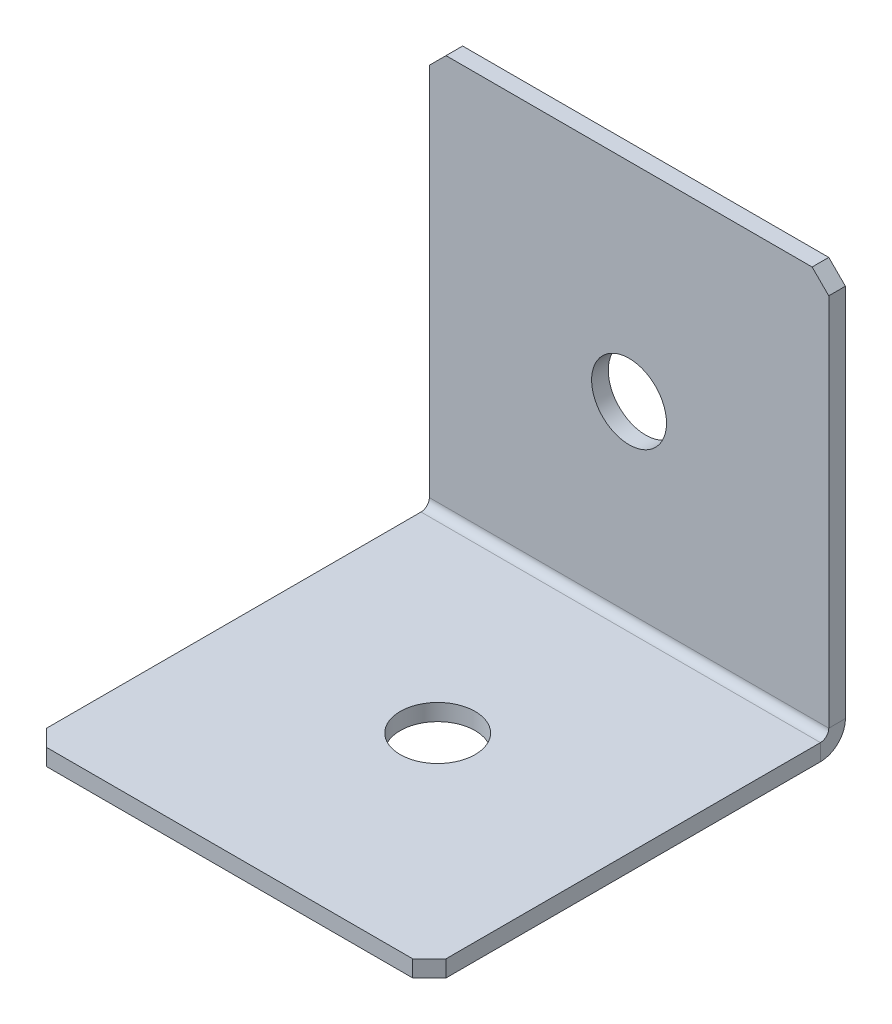
ISO-10303-21;
HEADER;
FILE_DESCRIPTION(('STEP AP214'),'2;1');
FILE_NAME('part.step','',(''),(''),'','','');
FILE_SCHEMA(('AUTOMOTIVE_DESIGN { 1 0 10303 214 1 1 1 1 }'));
ENDSEC;
DATA;
#1=APPLICATION_CONTEXT('core data for automotive mechanical design processes');
#2=APPLICATION_PROTOCOL_DEFINITION('international standard','automotive_design',2000,#1);
#3=PRODUCT_CONTEXT('',#1,'mechanical');
#4=PRODUCT('Part','Part','',(#3));
#5=PRODUCT_RELATED_PRODUCT_CATEGORY('part','',(#4));
#6=PRODUCT_DEFINITION_FORMATION('','',#4);
#7=PRODUCT_DEFINITION_CONTEXT('part definition',#1,'design');
#8=PRODUCT_DEFINITION('design','',#6,#7);
#9=PRODUCT_DEFINITION_SHAPE('','',#8);
#10=(LENGTH_UNIT() NAMED_UNIT(*) SI_UNIT(.MILLI.,.METRE.));
#11=(NAMED_UNIT(*) PLANE_ANGLE_UNIT() SI_UNIT($,.RADIAN.));
#12=(NAMED_UNIT(*) SI_UNIT($,.STERADIAN.) SOLID_ANGLE_UNIT());
#13=UNCERTAINTY_MEASURE_WITH_UNIT(LENGTH_MEASURE(1.E-05),#10,'distance_accuracy_value','');
#14=(GEOMETRIC_REPRESENTATION_CONTEXT(3) GLOBAL_UNCERTAINTY_ASSIGNED_CONTEXT((#13)) GLOBAL_UNIT_ASSIGNED_CONTEXT((#10,
#11,#12)) REPRESENTATION_CONTEXT('',''));
#15=CARTESIAN_POINT('',(0.,0.,0.));
#16=DIRECTION('',(0.,0.,1.));
#17=DIRECTION('',(1.,0.,0.));
#18=AXIS2_PLACEMENT_3D('',#15,#16,#17);
#19=CARTESIAN_POINT('',(24.,0.,2.));
#20=DIRECTION('',(-1.,0.,0.));
#21=DIRECTION('',(0.,1.,0.));
#22=AXIS2_PLACEMENT_3D('',#19,#20,#21);
#23=PLANE('',#22);
#24=DIRECTION('',(0.,1.,0.));
#25=VECTOR('',#24,1.);
#26=CARTESIAN_POINT('',(24.,0.,0.));
#27=LINE('',#26,#25);
#28=CARTESIAN_POINT('',(24.,3.,0.));
#29=VERTEX_POINT('',#28);
#30=CARTESIAN_POINT('',(24.,48.,0.));
#31=VERTEX_POINT('',#30);
#32=EDGE_CURVE('E259',#29,#31,#27,.T.);
#33=ORIENTED_EDGE('',*,*,#32,.T.);
#34=DIRECTION('',(0.,0.,-1.));
#35=VECTOR('',#34,1.);
#36=CARTESIAN_POINT('',(24.,48.,2.));
#37=LINE('',#36,#35);
#38=CARTESIAN_POINT('',(24.,48.,2.));
#39=VERTEX_POINT('',#38);
#40=EDGE_CURVE('E289',#31,#39,#37,.F.);
#41=ORIENTED_EDGE('',*,*,#40,.T.);
#42=DIRECTION('',(0.,1.,0.));
#43=VECTOR('',#42,1.);
#44=CARTESIAN_POINT('',(24.,0.,2.));
#45=LINE('',#44,#43);
#46=CARTESIAN_POINT('',(24.,3.,2.));
#47=VERTEX_POINT('',#46);
#48=EDGE_CURVE('E247',#47,#39,#45,.T.);
#49=ORIENTED_EDGE('',*,*,#48,.F.);
#50=DIRECTION('',(0.,0.,-1.));
#51=VECTOR('',#50,1.);
#52=CARTESIAN_POINT('',(24.,3.,2.));
#53=LINE('',#52,#51);
#54=EDGE_CURVE('E226',#47,#29,#53,.T.);
#55=ORIENTED_EDGE('',*,*,#54,.T.);
#56=EDGE_LOOP('',(#33,#41,#49,#55));
#57=FACE_BOUND('',#56,.T.);
#58=ADVANCED_FACE('F65',(#57),#23,.F.);
#59=CARTESIAN_POINT('',(0.,0.,2.));
#60=DIRECTION('',(0.,0.,-1.));
#61=DIRECTION('',(-1.,0.,0.));
#62=AXIS2_PLACEMENT_3D('',#59,#60,#61);
#63=PLANE('',#62);
#64=CARTESIAN_POINT('',(0.,25.,2.));
#65=DIRECTION('',(0.,0.,1.));
#66=DIRECTION('',(1.,0.,0.));
#67=AXIS2_PLACEMENT_3D('',#64,#65,#66);
#68=CIRCLE('',#67,4.5);
#69=CARTESIAN_POINT('',(4.5,25.,2.));
#70=VERTEX_POINT('',#69);
#71=EDGE_CURVE('E559',#70,#70,#68,.T.);
#72=ORIENTED_EDGE('',*,*,#71,.F.);
#73=EDGE_LOOP('',(#72));
#74=FACE_BOUND('',#73,.T.);
#75=ORIENTED_EDGE('',*,*,#48,.T.);
#76=DIRECTION('',(0.707106781186549,-0.707106781186546,0.));
#77=VECTOR('',#76,1.);
#78=CARTESIAN_POINT('',(24.,48.,2.));
#79=LINE('',#78,#77);
#80=CARTESIAN_POINT('',(22.,50.,2.));
#81=VERTEX_POINT('',#80);
#82=EDGE_CURVE('E296',#39,#81,#79,.F.);
#83=ORIENTED_EDGE('',*,*,#82,.T.);
#84=DIRECTION('',(-1.,0.,0.));
#85=VECTOR('',#84,1.);
#86=CARTESIAN_POINT('',(-24.,50.,2.));
#87=LINE('',#86,#85);
#88=CARTESIAN_POINT('',(-22.,50.,2.));
#89=VERTEX_POINT('',#88);
#90=EDGE_CURVE('E252',#81,#89,#87,.T.);
#91=ORIENTED_EDGE('',*,*,#90,.T.);
#92=DIRECTION('',(0.707106781186548,0.707106781186548,0.));
#93=VECTOR('',#92,1.);
#94=CARTESIAN_POINT('',(-22.,50.,2.));
#95=LINE('',#94,#93);
#96=CARTESIAN_POINT('',(-24.,48.,2.));
#97=VERTEX_POINT('',#96);
#98=EDGE_CURVE('E293',#89,#97,#95,.F.);
#99=ORIENTED_EDGE('',*,*,#98,.T.);
#100=DIRECTION('',(0.,-1.,0.));
#101=VECTOR('',#100,1.);
#102=CARTESIAN_POINT('',(-24.,0.,2.));
#103=LINE('',#102,#101);
#104=CARTESIAN_POINT('',(-24.,3.,2.));
#105=VERTEX_POINT('',#104);
#106=EDGE_CURVE('E244',#97,#105,#103,.T.);
#107=ORIENTED_EDGE('',*,*,#106,.T.);
#108=DIRECTION('',(1.,0.,0.));
#109=VECTOR('',#108,1.);
#110=CARTESIAN_POINT('',(24.,3.,2.));
#111=LINE('',#110,#109);
#112=EDGE_CURVE('E231',#47,#105,#111,.F.);
#113=ORIENTED_EDGE('',*,*,#112,.F.);
#114=EDGE_LOOP('',(#75,#83,#91,#99,#107,#113));
#115=FACE_BOUND('',#114,.T.);
#116=ADVANCED_FACE('F319',(#74,#115),#63,.F.);
#117=CARTESIAN_POINT('',(0.,0.,0.));
#118=DIRECTION('',(0.,0.,-1.));
#119=DIRECTION('',(-1.,0.,0.));
#120=AXIS2_PLACEMENT_3D('',#117,#118,#119);
#121=PLANE('',#120);
#122=CARTESIAN_POINT('',(0.,25.,0.));
#123=DIRECTION('',(0.,0.,-1.));
#124=DIRECTION('',(-1.,0.,0.));
#125=AXIS2_PLACEMENT_3D('',#122,#123,#124);
#126=CIRCLE('',#125,4.5);
#127=CARTESIAN_POINT('',(-4.5,25.,0.));
#128=VERTEX_POINT('',#127);
#129=EDGE_CURVE('E221',#128,#128,#126,.T.);
#130=ORIENTED_EDGE('',*,*,#129,.F.);
#131=EDGE_LOOP('',(#130));
#132=FACE_BOUND('',#131,.T.);
#133=DIRECTION('',(-1.,0.,0.));
#134=VECTOR('',#133,1.);
#135=CARTESIAN_POINT('',(0.,50.,0.));
#136=LINE('',#135,#134);
#137=CARTESIAN_POINT('',(22.,50.,0.));
#138=VERTEX_POINT('',#137);
#139=CARTESIAN_POINT('',(-22.,50.,0.));
#140=VERTEX_POINT('',#139);
#141=EDGE_CURVE('E248',#138,#140,#136,.T.);
#142=ORIENTED_EDGE('',*,*,#141,.F.);
#143=DIRECTION('',(-0.707106781186549,0.707106781186546,0.));
#144=VECTOR('',#143,1.);
#145=CARTESIAN_POINT('',(36.,36.0000000000001,0.));
#146=LINE('',#145,#144);
#147=EDGE_CURVE('E75',#138,#31,#146,.F.);
#148=ORIENTED_EDGE('',*,*,#147,.T.);
#149=ORIENTED_EDGE('',*,*,#32,.F.);
#150=DIRECTION('',(1.,0.,0.));
#151=VECTOR('',#150,1.);
#152=CARTESIAN_POINT('',(24.,3.,0.));
#153=LINE('',#152,#151);
#154=CARTESIAN_POINT('',(-24.,3.00000000000001,0.));
#155=VERTEX_POINT('',#154);
#156=EDGE_CURVE('E164',#29,#155,#153,.F.);
#157=ORIENTED_EDGE('',*,*,#156,.T.);
#158=DIRECTION('',(0.,1.,0.));
#159=VECTOR('',#158,1.);
#160=CARTESIAN_POINT('',(-24.,0.,0.));
#161=LINE('',#160,#159);
#162=CARTESIAN_POINT('',(-24.,48.,0.));
#163=VERTEX_POINT('',#162);
#164=EDGE_CURVE('E241',#163,#155,#161,.F.);
#165=ORIENTED_EDGE('',*,*,#164,.F.);
#166=DIRECTION('',(-0.707106781186548,-0.707106781186548,0.));
#167=VECTOR('',#166,1.);
#168=CARTESIAN_POINT('',(-36.,36.,0.));
#169=LINE('',#168,#167);
#170=EDGE_CURVE('E87',#163,#140,#169,.F.);
#171=ORIENTED_EDGE('',*,*,#170,.T.);
#172=EDGE_LOOP('',(#142,#148,#149,#157,#165,#171));
#173=FACE_BOUND('',#172,.T.);
#174=ADVANCED_FACE('F310',(#132,#173),#121,.T.);
#175=CARTESIAN_POINT('',(-24.,50.,2.));
#176=DIRECTION('',(0.,-1.,0.));
#177=DIRECTION('',(-1.,0.,0.));
#178=AXIS2_PLACEMENT_3D('',#175,#176,#177);
#179=PLANE('',#178);
#180=ORIENTED_EDGE('',*,*,#90,.F.);
#181=DIRECTION('',(0.,0.,1.));
#182=VECTOR('',#181,1.);
#183=CARTESIAN_POINT('',(22.,50.,2.));
#184=LINE('',#183,#182);
#185=EDGE_CURVE('E303',#81,#138,#184,.F.);
#186=ORIENTED_EDGE('',*,*,#185,.T.);
#187=ORIENTED_EDGE('',*,*,#141,.T.);
#188=DIRECTION('',(0.,0.,-1.));
#189=VECTOR('',#188,1.);
#190=CARTESIAN_POINT('',(-22.,50.,2.));
#191=LINE('',#190,#189);
#192=EDGE_CURVE('E299',#140,#89,#191,.F.);
#193=ORIENTED_EDGE('',*,*,#192,.T.);
#194=EDGE_LOOP('',(#180,#186,#187,#193));
#195=FACE_BOUND('',#194,.T.);
#196=ADVANCED_FACE('F322',(#195),#179,.F.);
#197=CARTESIAN_POINT('',(-24.,0.,2.));
#198=DIRECTION('',(1.,0.,0.));
#199=DIRECTION('',(0.,-1.,0.));
#200=AXIS2_PLACEMENT_3D('',#197,#198,#199);
#201=PLANE('',#200);
#202=ORIENTED_EDGE('',*,*,#106,.F.);
#203=DIRECTION('',(0.,0.,1.));
#204=VECTOR('',#203,1.);
#205=CARTESIAN_POINT('',(-24.,48.,2.));
#206=LINE('',#205,#204);
#207=EDGE_CURVE('E13',#97,#163,#206,.F.);
#208=ORIENTED_EDGE('',*,*,#207,.T.);
#209=ORIENTED_EDGE('',*,*,#164,.T.);
#210=DIRECTION('',(0.,0.,-1.));
#211=VECTOR('',#210,1.);
#212=CARTESIAN_POINT('',(-24.,3.,2.));
#213=LINE('',#212,#211);
#214=EDGE_CURVE('E237',#105,#155,#213,.T.);
#215=ORIENTED_EDGE('',*,*,#214,.F.);
#216=EDGE_LOOP('',(#202,#208,#209,#215));
#217=FACE_BOUND('',#216,.T.);
#218=ADVANCED_FACE('F326',(#217),#201,.F.);
#219=CARTESIAN_POINT('',(-24.,3.,3.));
#220=DIRECTION('',(-1.,0.,0.));
#221=DIRECTION('',(0.,0.,1.));
#222=AXIS2_PLACEMENT_3D('',#219,#220,#221);
#223=PLANE('',#222);
#224=DIRECTION('',(0.,1.,0.));
#225=VECTOR('',#224,1.);
#226=CARTESIAN_POINT('',(-24.,0.,2.99999999999999));
#227=LINE('',#226,#225);
#228=CARTESIAN_POINT('',(-24.,2.,3.));
#229=VERTEX_POINT('',#228);
#230=CARTESIAN_POINT('',(-24.,0.,2.99999999999999));
#231=VERTEX_POINT('',#230);
#232=EDGE_CURVE('E217',#229,#231,#227,.F.);
#233=ORIENTED_EDGE('',*,*,#232,.F.);
#234=CARTESIAN_POINT('',(-24.,3.,3.));
#235=DIRECTION('',(1.,0.,0.));
#236=DIRECTION('',(0.,0.,-1.));
#237=AXIS2_PLACEMENT_3D('',#234,#235,#236);
#238=CIRCLE('',#237,1.);
#239=EDGE_CURVE('E168',#105,#229,#238,.F.);
#240=ORIENTED_EDGE('',*,*,#239,.F.);
#241=ORIENTED_EDGE('',*,*,#214,.T.);
#242=CARTESIAN_POINT('',(-24.,3.,3.));
#243=DIRECTION('',(1.,0.,0.));
#244=DIRECTION('',(0.,0.,-1.));
#245=AXIS2_PLACEMENT_3D('',#242,#243,#244);
#246=CIRCLE('',#245,3.);
#247=EDGE_CURVE('E224',#155,#231,#246,.F.);
#248=ORIENTED_EDGE('',*,*,#247,.T.);
#249=EDGE_LOOP('',(#233,#240,#241,#248));
#250=FACE_BOUND('',#249,.T.);
#251=ADVANCED_FACE('F330',(#250),#223,.T.);
#252=CARTESIAN_POINT('',(24.,3.,3.));
#253=DIRECTION('',(-1.,0.,0.));
#254=DIRECTION('',(0.,0.,1.));
#255=AXIS2_PLACEMENT_3D('',#252,#253,#254);
#256=PLANE('',#255);
#257=CARTESIAN_POINT('',(24.,3.,3.));
#258=DIRECTION('',(1.,0.,0.));
#259=DIRECTION('',(0.,0.,-1.));
#260=AXIS2_PLACEMENT_3D('',#257,#258,#259);
#261=CIRCLE('',#260,1.);
#262=CARTESIAN_POINT('',(24.,2.,3.));
#263=VERTEX_POINT('',#262);
#264=EDGE_CURVE('E175',#263,#47,#261,.T.);
#265=ORIENTED_EDGE('',*,*,#264,.F.);
#266=DIRECTION('',(0.,1.,0.));
#267=VECTOR('',#266,1.);
#268=CARTESIAN_POINT('',(24.,2.,3.));
#269=LINE('',#268,#267);
#270=CARTESIAN_POINT('',(24.,0.,2.99999999999999));
#271=VERTEX_POINT('',#270);
#272=EDGE_CURVE('E172',#263,#271,#269,.F.);
#273=ORIENTED_EDGE('',*,*,#272,.T.);
#274=CARTESIAN_POINT('',(24.,3.,3.));
#275=DIRECTION('',(1.,0.,0.));
#276=DIRECTION('',(0.,0.,-1.));
#277=AXIS2_PLACEMENT_3D('',#274,#275,#276);
#278=CIRCLE('',#277,3.);
#279=EDGE_CURVE('E156',#271,#29,#278,.T.);
#280=ORIENTED_EDGE('',*,*,#279,.T.);
#281=ORIENTED_EDGE('',*,*,#54,.F.);
#282=EDGE_LOOP('',(#265,#273,#280,#281));
#283=FACE_BOUND('',#282,.T.);
#284=ADVANCED_FACE('F173',(#283),#256,.F.);
#285=CARTESIAN_POINT('',(24.,3.,3.));
#286=DIRECTION('',(1.,0.,0.));
#287=DIRECTION('',(0.,-1.,0.));
#288=AXIS2_PLACEMENT_3D('',#285,#286,#287);
#289=CYLINDRICAL_SURFACE('',#288,3.);
#290=ORIENTED_EDGE('',*,*,#156,.F.);
#291=ORIENTED_EDGE('',*,*,#279,.F.);
#292=DIRECTION('',(1.,0.,0.));
#293=VECTOR('',#292,1.);
#294=CARTESIAN_POINT('',(-24.,0.,2.99999999999999));
#295=LINE('',#294,#293);
#296=EDGE_CURVE('E161',#271,#231,#295,.F.);
#297=ORIENTED_EDGE('',*,*,#296,.T.);
#298=ORIENTED_EDGE('',*,*,#247,.F.);
#299=EDGE_LOOP('',(#290,#291,#297,#298));
#300=FACE_BOUND('',#299,.T.);
#301=ADVANCED_FACE('F158',(#300),#289,.T.);
#302=CARTESIAN_POINT('',(24.,3.,3.));
#303=DIRECTION('',(1.,0.,0.));
#304=DIRECTION('',(0.,-1.,0.));
#305=AXIS2_PLACEMENT_3D('',#302,#303,#304);
#306=CYLINDRICAL_SURFACE('',#305,1.);
#307=ORIENTED_EDGE('',*,*,#112,.T.);
#308=ORIENTED_EDGE('',*,*,#239,.T.);
#309=DIRECTION('',(1.,0.,0.));
#310=VECTOR('',#309,1.);
#311=CARTESIAN_POINT('',(-24.,2.,3.));
#312=LINE('',#311,#310);
#313=EDGE_CURVE('E181',#229,#263,#312,.T.);
#314=ORIENTED_EDGE('',*,*,#313,.T.);
#315=ORIENTED_EDGE('',*,*,#264,.T.);
#316=EDGE_LOOP('',(#307,#308,#314,#315));
#317=FACE_BOUND('',#316,.T.);
#318=ADVANCED_FACE('F333',(#317),#306,.F.);
#319=CARTESIAN_POINT('',(-24.,0.,1.99999999999999));
#320=DIRECTION('',(1.,0.,0.));
#321=DIRECTION('',(0.,0.,-1.));
#322=AXIS2_PLACEMENT_3D('',#319,#320,#321);
#323=PLANE('',#322);
#324=DIRECTION('',(0.,0.,-1.));
#325=VECTOR('',#324,1.);
#326=CARTESIAN_POINT('',(-24.,0.,0.));
#327=LINE('',#326,#325);
#328=CARTESIAN_POINT('',(-24.,-1.60652210360563E-13,48.));
#329=VERTEX_POINT('',#328);
#330=EDGE_CURVE('E189',#329,#231,#327,.T.);
#331=ORIENTED_EDGE('',*,*,#330,.F.);
#332=DIRECTION('',(0.,1.,0.));
#333=VECTOR('',#332,1.);
#334=CARTESIAN_POINT('',(-24.,-1.60608141586784E-13,48.));
#335=LINE('',#334,#333);
#336=CARTESIAN_POINT('',(-24.,1.99999999999984,48.));
#337=VERTEX_POINT('',#336);
#338=EDGE_CURVE('E285',#329,#337,#335,.T.);
#339=ORIENTED_EDGE('',*,*,#338,.T.);
#340=DIRECTION('',(0.,0.,1.));
#341=VECTOR('',#340,1.);
#342=CARTESIAN_POINT('',(-24.,2.,2.));
#343=LINE('',#342,#341);
#344=EDGE_CURVE('E191',#337,#229,#343,.F.);
#345=ORIENTED_EDGE('',*,*,#344,.T.);
#346=ORIENTED_EDGE('',*,*,#232,.T.);
#347=EDGE_LOOP('',(#331,#339,#345,#346));
#348=FACE_BOUND('',#347,.T.);
#349=ADVANCED_FACE('F350',(#348),#323,.F.);
#350=CARTESIAN_POINT('',(24.,-1.67400815431762E-13,50.));
#351=DIRECTION('',(-1.,0.,0.));
#352=DIRECTION('',(0.,0.,1.));
#353=AXIS2_PLACEMENT_3D('',#350,#351,#352);
#354=PLANE('',#353);
#355=DIRECTION('',(0.,0.,-1.));
#356=VECTOR('',#355,1.);
#357=CARTESIAN_POINT('',(24.,1.99999999999983,50.));
#358=LINE('',#357,#356);
#359=CARTESIAN_POINT('',(24.,1.99999999999984,48.));
#360=VERTEX_POINT('',#359);
#361=EDGE_CURVE('E210',#263,#360,#358,.F.);
#362=ORIENTED_EDGE('',*,*,#361,.T.);
#363=DIRECTION('',(0.,-1.,0.));
#364=VECTOR('',#363,1.);
#365=CARTESIAN_POINT('',(24.,-1.60417852754076E-13,48.));
#366=LINE('',#365,#364);
#367=CARTESIAN_POINT('',(24.,-1.60652210360563E-13,48.));
#368=VERTEX_POINT('',#367);
#369=EDGE_CURVE('E195',#360,#368,#366,.T.);
#370=ORIENTED_EDGE('',*,*,#369,.T.);
#371=DIRECTION('',(0.,0.,1.));
#372=VECTOR('',#371,1.);
#373=CARTESIAN_POINT('',(24.,0.,0.));
#374=LINE('',#373,#372);
#375=EDGE_CURVE('E186',#271,#368,#374,.T.);
#376=ORIENTED_EDGE('',*,*,#375,.F.);
#377=ORIENTED_EDGE('',*,*,#272,.F.);
#378=EDGE_LOOP('',(#362,#370,#376,#377));
#379=FACE_BOUND('',#378,.T.);
#380=ADVANCED_FACE('F193',(#379),#354,.F.);
#381=CARTESIAN_POINT('',(0.,0.,0.));
#382=DIRECTION('',(0.,1.,0.));
#383=DIRECTION('',(0.,0.,1.));
#384=AXIS2_PLACEMENT_3D('',#381,#382,#383);
#385=PLANE('',#384);
#386=CARTESIAN_POINT('',(0.,0.,25.));
#387=DIRECTION('',(0.,1.,0.));
#388=DIRECTION('',(0.,0.,1.));
#389=AXIS2_PLACEMENT_3D('',#386,#387,#388);
#390=CIRCLE('',#389,4.5);
#391=CARTESIAN_POINT('',(0.,0.,29.5));
#392=VERTEX_POINT('',#391);
#393=EDGE_CURVE('E564',#392,#392,#390,.T.);
#394=ORIENTED_EDGE('',*,*,#393,.T.);
#395=EDGE_LOOP('',(#394));
#396=FACE_BOUND('',#395,.T.);
#397=ORIENTED_EDGE('',*,*,#375,.T.);
#398=DIRECTION('',(0.707106781186546,0.,-0.707106781186549));
#399=VECTOR('',#398,1.);
#400=CARTESIAN_POINT('',(22.,-1.67400815431762E-13,50.));
#401=LINE('',#400,#399);
#402=CARTESIAN_POINT('',(22.,-1.67635173038249E-13,50.));
#403=VERTEX_POINT('',#402);
#404=EDGE_CURVE('E282',#368,#403,#401,.F.);
#405=ORIENTED_EDGE('',*,*,#404,.T.);
#406=DIRECTION('',(-1.,0.,0.));
#407=VECTOR('',#406,1.);
#408=CARTESIAN_POINT('',(0.,-1.67635173038249E-13,50.));
#409=LINE('',#408,#407);
#410=CARTESIAN_POINT('',(-22.,-1.67635173038249E-13,50.));
#411=VERTEX_POINT('',#410);
#412=EDGE_CURVE('E197',#403,#411,#409,.T.);
#413=ORIENTED_EDGE('',*,*,#412,.T.);
#414=DIRECTION('',(0.70710678118655,0.,0.707106781186545));
#415=VECTOR('',#414,1.);
#416=CARTESIAN_POINT('',(-24.,-1.60608141586784E-13,48.));
#417=LINE('',#416,#415);
#418=EDGE_CURVE('E279',#411,#329,#417,.F.);
#419=ORIENTED_EDGE('',*,*,#418,.T.);
#420=ORIENTED_EDGE('',*,*,#330,.T.);
#421=ORIENTED_EDGE('',*,*,#296,.F.);
#422=EDGE_LOOP('',(#397,#405,#413,#419,#420,#421));
#423=FACE_BOUND('',#422,.T.);
#424=ADVANCED_FACE('F185',(#396,#423),#385,.F.);
#425=CARTESIAN_POINT('',(0.,2.00000000000001,0.));
#426=DIRECTION('',(0.,1.,0.));
#427=DIRECTION('',(0.,0.,1.));
#428=AXIS2_PLACEMENT_3D('',#425,#426,#427);
#429=PLANE('',#428);
#430=CARTESIAN_POINT('',(0.,1.99999999999992,25.));
#431=DIRECTION('',(0.,1.,0.));
#432=DIRECTION('',(0.,0.,1.));
#433=AXIS2_PLACEMENT_3D('',#430,#431,#432);
#434=CIRCLE('',#433,4.5);
#435=CARTESIAN_POINT('',(0.,1.9999999999999,29.5));
#436=VERTEX_POINT('',#435);
#437=EDGE_CURVE('E570',#436,#436,#434,.T.);
#438=ORIENTED_EDGE('',*,*,#437,.F.);
#439=EDGE_LOOP('',(#438));
#440=FACE_BOUND('',#439,.T.);
#441=DIRECTION('',(1.,0.,0.));
#442=VECTOR('',#441,1.);
#443=CARTESIAN_POINT('',(-24.,1.99999999999983,50.));
#444=LINE('',#443,#442);
#445=CARTESIAN_POINT('',(22.,1.99999999999983,50.));
#446=VERTEX_POINT('',#445);
#447=CARTESIAN_POINT('',(-22.,1.99999999999983,50.));
#448=VERTEX_POINT('',#447);
#449=EDGE_CURVE('E203',#446,#448,#444,.F.);
#450=ORIENTED_EDGE('',*,*,#449,.F.);
#451=DIRECTION('',(-0.707106781186546,0.,0.707106781186549));
#452=VECTOR('',#451,1.);
#453=CARTESIAN_POINT('',(36.,1.99999999999988,35.9999999999999));
#454=LINE('',#453,#452);
#455=EDGE_CURVE('E274',#446,#360,#454,.F.);
#456=ORIENTED_EDGE('',*,*,#455,.T.);
#457=ORIENTED_EDGE('',*,*,#361,.F.);
#458=ORIENTED_EDGE('',*,*,#313,.F.);
#459=ORIENTED_EDGE('',*,*,#344,.F.);
#460=DIRECTION('',(-0.70710678118655,0.,-0.707106781186545));
#461=VECTOR('',#460,1.);
#462=CARTESIAN_POINT('',(-35.9999999999999,1.99999999999988,36.0000000000002));
#463=LINE('',#462,#461);
#464=EDGE_CURVE('E271',#337,#448,#463,.F.);
#465=ORIENTED_EDGE('',*,*,#464,.T.);
#466=EDGE_LOOP('',(#450,#456,#457,#458,#459,#465));
#467=FACE_BOUND('',#466,.T.);
#468=ADVANCED_FACE('F337',(#440,#467),#429,.T.);
#469=CARTESIAN_POINT('',(-24.,-1.67400815431762E-13,50.));
#470=DIRECTION('',(0.,0.,-1.));
#471=DIRECTION('',(0.,1.,0.));
#472=AXIS2_PLACEMENT_3D('',#469,#470,#471);
#473=PLANE('',#472);
#474=ORIENTED_EDGE('',*,*,#412,.F.);
#475=DIRECTION('',(0.,1.,0.));
#476=VECTOR('',#475,1.);
#477=CARTESIAN_POINT('',(22.,-1.67400815431762E-13,50.));
#478=LINE('',#477,#476);
#479=EDGE_CURVE('E267',#403,#446,#478,.T.);
#480=ORIENTED_EDGE('',*,*,#479,.T.);
#481=ORIENTED_EDGE('',*,*,#449,.T.);
#482=DIRECTION('',(0.,-1.,0.));
#483=VECTOR('',#482,1.);
#484=CARTESIAN_POINT('',(-22.,-1.67400815431762E-13,50.));
#485=LINE('',#484,#483);
#486=EDGE_CURVE('E256',#448,#411,#485,.T.);
#487=ORIENTED_EDGE('',*,*,#486,.T.);
#488=EDGE_LOOP('',(#474,#480,#481,#487));
#489=FACE_BOUND('',#488,.T.);
#490=ADVANCED_FACE('F344',(#489),#473,.F.);
#491=CARTESIAN_POINT('',(0.,25.,2.));
#492=DIRECTION('',(0.,0.,1.));
#493=DIRECTION('',(1.,0.,0.));
#494=AXIS2_PLACEMENT_3D('',#491,#492,#493);
#495=CYLINDRICAL_SURFACE('',#494,4.5);
#496=ORIENTED_EDGE('',*,*,#71,.T.);
#497=EDGE_LOOP('',(#496));
#498=FACE_BOUND('',#497,.T.);
#499=ORIENTED_EDGE('',*,*,#129,.T.);
#500=EDGE_LOOP('',(#499));
#501=FACE_BOUND('',#500,.T.);
#502=ADVANCED_FACE('F416',(#498,#501),#495,.F.);
#503=CARTESIAN_POINT('',(0.,1.99999999999992,25.));
#504=DIRECTION('',(0.,1.,0.));
#505=DIRECTION('',(0.,0.,1.));
#506=AXIS2_PLACEMENT_3D('',#503,#504,#505);
#507=CYLINDRICAL_SURFACE('',#506,4.5);
#508=ORIENTED_EDGE('',*,*,#393,.F.);
#509=EDGE_LOOP('',(#508));
#510=FACE_BOUND('',#509,.T.);
#511=ORIENTED_EDGE('',*,*,#437,.T.);
#512=EDGE_LOOP('',(#511));
#513=FACE_BOUND('',#512,.T.);
#514=ADVANCED_FACE('F376',(#510,#513),#507,.F.);
#515=CARTESIAN_POINT('',(22.,-1.67400815431762E-13,50.));
#516=DIRECTION('',(-0.707106781186549,0.,-0.707106781186546));
#517=DIRECTION('',(0.,1.,0.));
#518=AXIS2_PLACEMENT_3D('',#515,#516,#517);
#519=PLANE('',#518);
#520=ORIENTED_EDGE('',*,*,#404,.F.);
#521=ORIENTED_EDGE('',*,*,#369,.F.);
#522=ORIENTED_EDGE('',*,*,#455,.F.);
#523=ORIENTED_EDGE('',*,*,#479,.F.);
#524=EDGE_LOOP('',(#520,#521,#522,#523));
#525=FACE_BOUND('',#524,.T.);
#526=ADVANCED_FACE('F339',(#525),#519,.F.);
#527=CARTESIAN_POINT('',(-24.,-1.60608141586784E-13,48.));
#528=DIRECTION('',(0.707106781186545,0.,-0.70710678118655));
#529=DIRECTION('',(0.,1.,0.));
#530=AXIS2_PLACEMENT_3D('',#527,#528,#529);
#531=PLANE('',#530);
#532=ORIENTED_EDGE('',*,*,#418,.F.);
#533=ORIENTED_EDGE('',*,*,#486,.F.);
#534=ORIENTED_EDGE('',*,*,#464,.F.);
#535=ORIENTED_EDGE('',*,*,#338,.F.);
#536=EDGE_LOOP('',(#532,#533,#534,#535));
#537=FACE_BOUND('',#536,.T.);
#538=ADVANCED_FACE('F347',(#537),#531,.F.);
#539=CARTESIAN_POINT('',(24.,48.,2.));
#540=DIRECTION('',(-0.707106781186546,-0.707106781186549,0.));
#541=DIRECTION('',(0.,0.,1.));
#542=AXIS2_PLACEMENT_3D('',#539,#540,#541);
#543=PLANE('',#542);
#544=ORIENTED_EDGE('',*,*,#147,.F.);
#545=ORIENTED_EDGE('',*,*,#185,.F.);
#546=ORIENTED_EDGE('',*,*,#82,.F.);
#547=ORIENTED_EDGE('',*,*,#40,.F.);
#548=EDGE_LOOP('',(#544,#545,#546,#547));
#549=FACE_BOUND('',#548,.T.);
#550=ADVANCED_FACE('F316',(#549),#543,.F.);
#551=CARTESIAN_POINT('',(-22.,50.,2.));
#552=DIRECTION('',(0.707106781186547,-0.707106781186547,0.));
#553=DIRECTION('',(0.,0.,1.));
#554=AXIS2_PLACEMENT_3D('',#551,#552,#553);
#555=PLANE('',#554);
#556=ORIENTED_EDGE('',*,*,#170,.F.);
#557=ORIENTED_EDGE('',*,*,#207,.F.);
#558=ORIENTED_EDGE('',*,*,#98,.F.);
#559=ORIENTED_EDGE('',*,*,#192,.F.);
#560=EDGE_LOOP('',(#556,#557,#558,#559));
#561=FACE_BOUND('',#560,.T.);
#562=ADVANCED_FACE('F68',(#561),#555,.F.);
#563=CLOSED_SHELL('',(#58,#116,#174,#196,#218,#251,#284,#301,#318,#349,#380,#424,#468,#490,#502,
#514,#526,#538,#550,#562));
#564=MANIFOLD_SOLID_BREP('B2',#563);
#565=ADVANCED_BREP_SHAPE_REPRESENTATION('',(#18,#564),#14);
#566=SHAPE_DEFINITION_REPRESENTATION(#9,#565);
ENDSEC;
END-ISO-10303-21;
